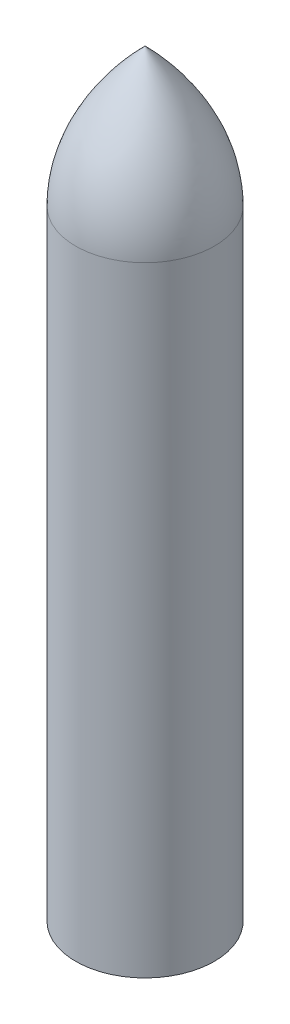
ISO-10303-21;
HEADER;
FILE_DESCRIPTION(('STEP AP214'),'2;1');
FILE_NAME('part.step','',(''),(''),'','','');
FILE_SCHEMA(('AUTOMOTIVE_DESIGN { 1 0 10303 214 1 1 1 1 }'));
ENDSEC;
DATA;
#1=APPLICATION_CONTEXT('core data for automotive mechanical design processes');
#2=APPLICATION_PROTOCOL_DEFINITION('international standard','automotive_design',2000,#1);
#3=PRODUCT_CONTEXT('',#1,'mechanical');
#4=PRODUCT('Part','Part','',(#3));
#5=PRODUCT_RELATED_PRODUCT_CATEGORY('part','',(#4));
#6=PRODUCT_DEFINITION_FORMATION('','',#4);
#7=PRODUCT_DEFINITION_CONTEXT('part definition',#1,'design');
#8=PRODUCT_DEFINITION('design','',#6,#7);
#9=PRODUCT_DEFINITION_SHAPE('','',#8);
#10=(LENGTH_UNIT() NAMED_UNIT(*) SI_UNIT(.MILLI.,.METRE.));
#11=(NAMED_UNIT(*) PLANE_ANGLE_UNIT() SI_UNIT($,.RADIAN.));
#12=(NAMED_UNIT(*) SI_UNIT($,.STERADIAN.) SOLID_ANGLE_UNIT());
#13=UNCERTAINTY_MEASURE_WITH_UNIT(LENGTH_MEASURE(1.E-05),#10,'distance_accuracy_value','');
#14=(GEOMETRIC_REPRESENTATION_CONTEXT(3) GLOBAL_UNCERTAINTY_ASSIGNED_CONTEXT((#13)) GLOBAL_UNIT_ASSIGNED_CONTEXT((#10,
#11,#12)) REPRESENTATION_CONTEXT('',''));
#15=CARTESIAN_POINT('',(0.,0.,0.));
#16=DIRECTION('',(0.,0.,1.));
#17=DIRECTION('',(1.,0.,0.));
#18=AXIS2_PLACEMENT_3D('',#15,#16,#17);
#19=CARTESIAN_POINT('',(0.,0.,0.));
#20=DIRECTION('',(0.,1.,0.));
#21=DIRECTION('',(0.,0.,1.));
#22=AXIS2_PLACEMENT_3D('',#19,#20,#21);
#23=PLANE('',#22);
#24=CARTESIAN_POINT('',(0.,0.,0.));
#25=DIRECTION('',(0.,-1.,0.));
#26=DIRECTION('',(0.,0.,-1.));
#27=AXIS2_PLACEMENT_3D('',#24,#25,#26);
#28=CIRCLE('',#27,150.);
#29=CARTESIAN_POINT('',(0.,0.,-150.));
#30=VERTEX_POINT('',#29);
#31=EDGE_CURVE('E11',#30,#30,#28,.T.);
#32=ORIENTED_EDGE('',*,*,#31,.T.);
#33=EDGE_LOOP('',(#32));
#34=FACE_BOUND('',#33,.T.);
#35=ADVANCED_FACE('F33',(#34),#23,.F.);
#36=CARTESIAN_POINT('',(0.,0.,0.));
#37=DIRECTION('',(0.,-1.,0.));
#38=DIRECTION('',(0.,0.,-1.));
#39=AXIS2_PLACEMENT_3D('',#36,#37,#38);
#40=CYLINDRICAL_SURFACE('',#39,150.);
#41=ORIENTED_EDGE('',*,*,#31,.F.);
#42=EDGE_LOOP('',(#41));
#43=FACE_BOUND('',#42,.T.);
#44=CARTESIAN_POINT('',(0.,1340.,0.));
#45=DIRECTION('',(0.,-1.,0.));
#46=DIRECTION('',(0.,0.,-1.));
#47=AXIS2_PLACEMENT_3D('',#44,#45,#46);
#48=CIRCLE('',#47,150.);
#49=CARTESIAN_POINT('',(0.,1340.,-150.));
#50=VERTEX_POINT('',#49);
#51=EDGE_CURVE('E39',#50,#50,#48,.T.);
#52=ORIENTED_EDGE('',*,*,#51,.T.);
#53=EDGE_LOOP('',(#52));
#54=FACE_BOUND('',#53,.T.);
#55=ADVANCED_FACE('F44',(#43,#54),#40,.T.);
#56=CARTESIAN_POINT('',(0.,1640.,0.));
#57=CARTESIAN_POINT('',(-150.,1490.,0.));
#58=CARTESIAN_POINT('',(-150.,1340.,0.));
#59=B_SPLINE_CURVE_WITH_KNOTS('',2,(#56,#57,#58),.UNSPECIFIED.,.F.,.F.,(3,3),(0.,1.),.UNSPECIFIED.);
#60=CARTESIAN_POINT('',(0.,0.,0.));
#61=DIRECTION('',(0.,-1.,0.));
#62=AXIS1_PLACEMENT('',#60,#61);
#63=SURFACE_OF_REVOLUTION('',#59,#62);
#64=ORIENTED_EDGE('',*,*,#51,.F.);
#65=EDGE_LOOP('',(#64));
#66=FACE_BOUND('',#65,.T.);
#67=CARTESIAN_POINT('',(0.,1640.,0.));
#68=VERTEX_POINT('',#67);
#69=VERTEX_LOOP('',#68);
#70=FACE_BOUND('',#69,.T.);
#71=ADVANCED_FACE('F42',(#66,#70),#63,.T.);
#72=CLOSED_SHELL('',(#35,#55,#71));
#73=MANIFOLD_SOLID_BREP('B2',#72);
#74=ADVANCED_BREP_SHAPE_REPRESENTATION('',(#18,#73),#14);
#75=SHAPE_DEFINITION_REPRESENTATION(#9,#74);
ENDSEC;
END-ISO-10303-21;
